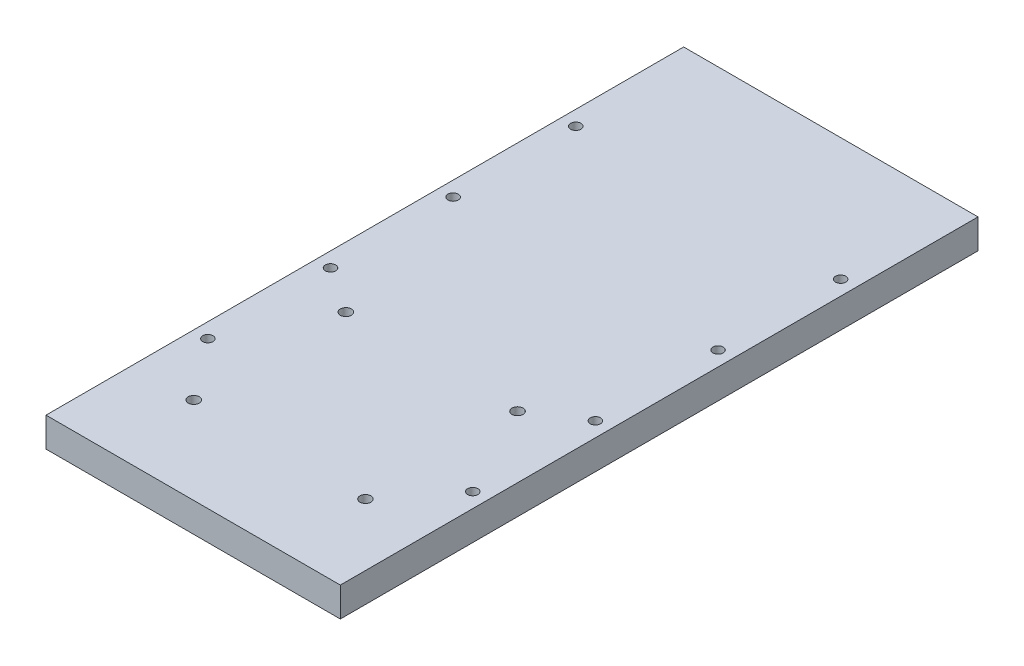
ISO-10303-21;
HEADER;
FILE_DESCRIPTION(('STEP AP214'),'2;1');
FILE_NAME('part.step','',(''),(''),'','','');
FILE_SCHEMA(('AUTOMOTIVE_DESIGN { 1 0 10303 214 1 1 1 1 }'));
ENDSEC;
DATA;
#1=APPLICATION_CONTEXT('core data for automotive mechanical design processes');
#2=APPLICATION_PROTOCOL_DEFINITION('international standard','automotive_design',2000,#1);
#3=PRODUCT_CONTEXT('',#1,'mechanical');
#4=PRODUCT('Part','Part','',(#3));
#5=PRODUCT_RELATED_PRODUCT_CATEGORY('part','',(#4));
#6=PRODUCT_DEFINITION_FORMATION('','',#4);
#7=PRODUCT_DEFINITION_CONTEXT('part definition',#1,'design');
#8=PRODUCT_DEFINITION('design','',#6,#7);
#9=PRODUCT_DEFINITION_SHAPE('','',#8);
#10=(LENGTH_UNIT() NAMED_UNIT(*) SI_UNIT(.MILLI.,.METRE.));
#11=(NAMED_UNIT(*) PLANE_ANGLE_UNIT() SI_UNIT($,.RADIAN.));
#12=(NAMED_UNIT(*) SI_UNIT($,.STERADIAN.) SOLID_ANGLE_UNIT());
#13=UNCERTAINTY_MEASURE_WITH_UNIT(LENGTH_MEASURE(1.E-05),#10,'distance_accuracy_value','');
#14=(GEOMETRIC_REPRESENTATION_CONTEXT(3) GLOBAL_UNCERTAINTY_ASSIGNED_CONTEXT((#13)) GLOBAL_UNIT_ASSIGNED_CONTEXT((#10,
#11,#12)) REPRESENTATION_CONTEXT('',''));
#15=CARTESIAN_POINT('',(0.,0.,0.));
#16=DIRECTION('',(0.,0.,1.));
#17=DIRECTION('',(1.,0.,0.));
#18=AXIS2_PLACEMENT_3D('',#15,#16,#17);
#19=CARTESIAN_POINT('',(0.,0.,-115.));
#20=DIRECTION('',(0.,0.,-1.));
#21=DIRECTION('',(-1.,0.,0.));
#22=AXIS2_PLACEMENT_3D('',#19,#20,#21);
#23=PLANE('',#22);
#24=CARTESIAN_POINT('',(-54.,6.,-115.));
#25=DIRECTION('',(0.,0.,-1.));
#26=DIRECTION('',(-1.,0.,0.));
#27=AXIS2_PLACEMENT_3D('',#24,#25,#26);
#28=CIRCLE('',#27,2.25);
#29=CARTESIAN_POINT('',(-56.25,6.,-115.));
#30=VERTEX_POINT('',#29);
#31=EDGE_CURVE('E196',#30,#30,#28,.T.);
#32=ORIENTED_EDGE('',*,*,#31,.T.);
#33=EDGE_LOOP('',(#32));
#34=FACE_BOUND('',#33,.T.);
#35=ADVANCED_FACE('F17',(#34),#23,.T.);
#36=CARTESIAN_POINT('',(0.,0.,-115.));
#37=DIRECTION('',(0.,0.,-1.));
#38=DIRECTION('',(-1.,0.,0.));
#39=AXIS2_PLACEMENT_3D('',#36,#37,#38);
#40=PLANE('',#39);
#41=CARTESIAN_POINT('',(0.,6.,-115.));
#42=DIRECTION('',(0.,0.,-1.));
#43=DIRECTION('',(-1.,0.,0.));
#44=AXIS2_PLACEMENT_3D('',#41,#42,#43);
#45=CIRCLE('',#44,2.25);
#46=CARTESIAN_POINT('',(-2.25,6.,-115.));
#47=VERTEX_POINT('',#46);
#48=EDGE_CURVE('E193',#47,#47,#45,.T.);
#49=ORIENTED_EDGE('',*,*,#48,.T.);
#50=EDGE_LOOP('',(#49));
#51=FACE_BOUND('',#50,.T.);
#52=ADVANCED_FACE('F395',(#51),#40,.T.);
#53=CARTESIAN_POINT('',(0.,0.,-115.));
#54=DIRECTION('',(0.,0.,-1.));
#55=DIRECTION('',(-1.,0.,0.));
#56=AXIS2_PLACEMENT_3D('',#53,#54,#55);
#57=PLANE('',#56);
#58=CARTESIAN_POINT('',(54.,6.,-115.));
#59=DIRECTION('',(0.,0.,-1.));
#60=DIRECTION('',(-1.,0.,0.));
#61=AXIS2_PLACEMENT_3D('',#58,#59,#60);
#62=CIRCLE('',#61,2.25);
#63=CARTESIAN_POINT('',(51.75,6.,-115.));
#64=VERTEX_POINT('',#63);
#65=EDGE_CURVE('E190',#64,#64,#62,.T.);
#66=ORIENTED_EDGE('',*,*,#65,.T.);
#67=EDGE_LOOP('',(#66));
#68=FACE_BOUND('',#67,.T.);
#69=ADVANCED_FACE('F392',(#68),#57,.T.);
#70=CARTESIAN_POINT('',(54.,0.,70.));
#71=DIRECTION('',(0.,-1.,0.));
#72=DIRECTION('',(0.,0.,-1.));
#73=AXIS2_PLACEMENT_3D('',#70,#71,#72);
#74=CYLINDRICAL_SURFACE('',#73,3.60000000000001);
#75=CARTESIAN_POINT('',(54.,6.,70.));
#76=DIRECTION('',(0.,-1.,0.));
#77=DIRECTION('',(0.,0.,-1.));
#78=AXIS2_PLACEMENT_3D('',#75,#76,#77);
#79=CIRCLE('',#78,3.60000000000001);
#80=CARTESIAN_POINT('',(54.,6.,66.4));
#81=VERTEX_POINT('',#80);
#82=EDGE_CURVE('E214',#81,#81,#79,.T.);
#83=ORIENTED_EDGE('',*,*,#82,.F.);
#84=EDGE_LOOP('',(#83));
#85=FACE_BOUND('',#84,.T.);
#86=CARTESIAN_POINT('',(54.,0.,70.));
#87=DIRECTION('',(0.,-1.,0.));
#88=DIRECTION('',(0.,0.,-1.));
#89=AXIS2_PLACEMENT_3D('',#86,#87,#88);
#90=CIRCLE('',#89,3.60000000000001);
#91=CARTESIAN_POINT('',(54.,0.,66.4));
#92=VERTEX_POINT('',#91);
#93=EDGE_CURVE('E187',#92,#92,#90,.T.);
#94=ORIENTED_EDGE('',*,*,#93,.T.);
#95=EDGE_LOOP('',(#94));
#96=FACE_BOUND('',#95,.T.);
#97=ADVANCED_FACE('F388',(#85,#96),#74,.F.);
#98=CARTESIAN_POINT('',(54.,0.,20.));
#99=DIRECTION('',(0.,-1.,0.));
#100=DIRECTION('',(0.,0.,-1.));
#101=AXIS2_PLACEMENT_3D('',#98,#99,#100);
#102=CYLINDRICAL_SURFACE('',#101,3.6);
#103=CARTESIAN_POINT('',(54.,6.,20.));
#104=DIRECTION('',(0.,-1.,0.));
#105=DIRECTION('',(0.,0.,-1.));
#106=AXIS2_PLACEMENT_3D('',#103,#104,#105);
#107=CIRCLE('',#106,3.6);
#108=CARTESIAN_POINT('',(54.,6.,16.4));
#109=VERTEX_POINT('',#108);
#110=EDGE_CURVE('E211',#109,#109,#107,.T.);
#111=ORIENTED_EDGE('',*,*,#110,.F.);
#112=EDGE_LOOP('',(#111));
#113=FACE_BOUND('',#112,.T.);
#114=CARTESIAN_POINT('',(54.,0.,20.));
#115=DIRECTION('',(0.,-1.,0.));
#116=DIRECTION('',(0.,0.,-1.));
#117=AXIS2_PLACEMENT_3D('',#114,#115,#116);
#118=CIRCLE('',#117,3.6);
#119=CARTESIAN_POINT('',(54.,0.,16.4));
#120=VERTEX_POINT('',#119);
#121=EDGE_CURVE('E184',#120,#120,#118,.T.);
#122=ORIENTED_EDGE('',*,*,#121,.T.);
#123=EDGE_LOOP('',(#122));
#124=FACE_BOUND('',#123,.T.);
#125=ADVANCED_FACE('F384',(#113,#124),#102,.F.);
#126=CARTESIAN_POINT('',(54.,0.,-30.));
#127=DIRECTION('',(0.,-1.,0.));
#128=DIRECTION('',(0.,0.,-1.));
#129=AXIS2_PLACEMENT_3D('',#126,#127,#128);
#130=CYLINDRICAL_SURFACE('',#129,3.6);
#131=CARTESIAN_POINT('',(54.,6.,-30.));
#132=DIRECTION('',(0.,-1.,0.));
#133=DIRECTION('',(0.,0.,-1.));
#134=AXIS2_PLACEMENT_3D('',#131,#132,#133);
#135=CIRCLE('',#134,3.6);
#136=CARTESIAN_POINT('',(54.,6.,-33.6));
#137=VERTEX_POINT('',#136);
#138=EDGE_CURVE('E205',#137,#137,#135,.T.);
#139=ORIENTED_EDGE('',*,*,#138,.F.);
#140=EDGE_LOOP('',(#139));
#141=FACE_BOUND('',#140,.T.);
#142=CARTESIAN_POINT('',(54.,0.,-30.));
#143=DIRECTION('',(0.,-1.,0.));
#144=DIRECTION('',(0.,0.,-1.));
#145=AXIS2_PLACEMENT_3D('',#142,#143,#144);
#146=CIRCLE('',#145,3.6);
#147=CARTESIAN_POINT('',(54.,0.,-33.6));
#148=VERTEX_POINT('',#147);
#149=EDGE_CURVE('E181',#148,#148,#146,.T.);
#150=ORIENTED_EDGE('',*,*,#149,.T.);
#151=EDGE_LOOP('',(#150));
#152=FACE_BOUND('',#151,.T.);
#153=ADVANCED_FACE('F380',(#141,#152),#130,.F.);
#154=CARTESIAN_POINT('',(54.,0.,-80.));
#155=DIRECTION('',(0.,-1.,0.));
#156=DIRECTION('',(0.,0.,-1.));
#157=AXIS2_PLACEMENT_3D('',#154,#155,#156);
#158=CYLINDRICAL_SURFACE('',#157,3.60000000000001);
#159=CARTESIAN_POINT('',(54.,6.,-80.));
#160=DIRECTION('',(0.,-1.,0.));
#161=DIRECTION('',(0.,0.,-1.));
#162=AXIS2_PLACEMENT_3D('',#159,#160,#161);
#163=CIRCLE('',#162,3.60000000000001);
#164=CARTESIAN_POINT('',(54.,6.,-83.6));
#165=VERTEX_POINT('',#164);
#166=EDGE_CURVE('E208',#165,#165,#163,.T.);
#167=ORIENTED_EDGE('',*,*,#166,.F.);
#168=EDGE_LOOP('',(#167));
#169=FACE_BOUND('',#168,.T.);
#170=CARTESIAN_POINT('',(54.,0.,-80.));
#171=DIRECTION('',(0.,-1.,0.));
#172=DIRECTION('',(0.,0.,-1.));
#173=AXIS2_PLACEMENT_3D('',#170,#171,#172);
#174=CIRCLE('',#173,3.60000000000001);
#175=CARTESIAN_POINT('',(54.,0.,-83.6));
#176=VERTEX_POINT('',#175);
#177=EDGE_CURVE('E178',#176,#176,#174,.T.);
#178=ORIENTED_EDGE('',*,*,#177,.T.);
#179=EDGE_LOOP('',(#178));
#180=FACE_BOUND('',#179,.T.);
#181=ADVANCED_FACE('F376',(#169,#180),#158,.F.);
#182=CARTESIAN_POINT('',(-54.,0.,70.));
#183=DIRECTION('',(0.,-1.,0.));
#184=DIRECTION('',(0.,0.,-1.));
#185=AXIS2_PLACEMENT_3D('',#182,#183,#184);
#186=CYLINDRICAL_SURFACE('',#185,3.60000000000001);
#187=CARTESIAN_POINT('',(-54.,6.,70.));
#188=DIRECTION('',(0.,-1.,0.));
#189=DIRECTION('',(0.,0.,-1.));
#190=AXIS2_PLACEMENT_3D('',#187,#188,#189);
#191=CIRCLE('',#190,3.60000000000001);
#192=CARTESIAN_POINT('',(-54.,6.,66.4));
#193=VERTEX_POINT('',#192);
#194=EDGE_CURVE('E216',#193,#193,#191,.T.);
#195=ORIENTED_EDGE('',*,*,#194,.F.);
#196=EDGE_LOOP('',(#195));
#197=FACE_BOUND('',#196,.T.);
#198=CARTESIAN_POINT('',(-54.,0.,70.));
#199=DIRECTION('',(0.,-1.,0.));
#200=DIRECTION('',(0.,0.,-1.));
#201=AXIS2_PLACEMENT_3D('',#198,#199,#200);
#202=CIRCLE('',#201,3.60000000000001);
#203=CARTESIAN_POINT('',(-54.,0.,66.4));
#204=VERTEX_POINT('',#203);
#205=EDGE_CURVE('E175',#204,#204,#202,.T.);
#206=ORIENTED_EDGE('',*,*,#205,.T.);
#207=EDGE_LOOP('',(#206));
#208=FACE_BOUND('',#207,.T.);
#209=ADVANCED_FACE('F230',(#197,#208),#186,.F.);
#210=CARTESIAN_POINT('',(-54.,0.,20.));
#211=DIRECTION('',(0.,-1.,0.));
#212=DIRECTION('',(0.,0.,-1.));
#213=AXIS2_PLACEMENT_3D('',#210,#211,#212);
#214=CYLINDRICAL_SURFACE('',#213,3.6);
#215=CARTESIAN_POINT('',(-54.,6.,20.));
#216=DIRECTION('',(0.,-1.,0.));
#217=DIRECTION('',(0.,0.,-1.));
#218=AXIS2_PLACEMENT_3D('',#215,#216,#217);
#219=CIRCLE('',#218,3.6);
#220=CARTESIAN_POINT('',(-54.,6.,16.4));
#221=VERTEX_POINT('',#220);
#222=EDGE_CURVE('E20',#221,#221,#219,.T.);
#223=ORIENTED_EDGE('',*,*,#222,.F.);
#224=EDGE_LOOP('',(#223));
#225=FACE_BOUND('',#224,.T.);
#226=CARTESIAN_POINT('',(-54.,0.,20.));
#227=DIRECTION('',(0.,-1.,0.));
#228=DIRECTION('',(0.,0.,-1.));
#229=AXIS2_PLACEMENT_3D('',#226,#227,#228);
#230=CIRCLE('',#229,3.6);
#231=CARTESIAN_POINT('',(-54.,0.,16.4));
#232=VERTEX_POINT('',#231);
#233=EDGE_CURVE('E172',#232,#232,#230,.T.);
#234=ORIENTED_EDGE('',*,*,#233,.T.);
#235=EDGE_LOOP('',(#234));
#236=FACE_BOUND('',#235,.T.);
#237=ADVANCED_FACE('F226',(#225,#236),#214,.F.);
#238=CARTESIAN_POINT('',(-54.,0.,-30.));
#239=DIRECTION('',(0.,-1.,0.));
#240=DIRECTION('',(0.,0.,-1.));
#241=AXIS2_PLACEMENT_3D('',#238,#239,#240);
#242=CYLINDRICAL_SURFACE('',#241,3.6);
#243=CARTESIAN_POINT('',(-54.,6.,-30.));
#244=DIRECTION('',(0.,-1.,0.));
#245=DIRECTION('',(0.,0.,-1.));
#246=AXIS2_PLACEMENT_3D('',#243,#244,#245);
#247=CIRCLE('',#246,3.6);
#248=CARTESIAN_POINT('',(-54.,6.,-33.6));
#249=VERTEX_POINT('',#248);
#250=EDGE_CURVE('E199',#249,#249,#247,.T.);
#251=ORIENTED_EDGE('',*,*,#250,.F.);
#252=EDGE_LOOP('',(#251));
#253=FACE_BOUND('',#252,.T.);
#254=CARTESIAN_POINT('',(-54.,0.,-30.));
#255=DIRECTION('',(0.,-1.,0.));
#256=DIRECTION('',(0.,0.,-1.));
#257=AXIS2_PLACEMENT_3D('',#254,#255,#256);
#258=CIRCLE('',#257,3.6);
#259=CARTESIAN_POINT('',(-54.,0.,-33.6));
#260=VERTEX_POINT('',#259);
#261=EDGE_CURVE('E169',#260,#260,#258,.T.);
#262=ORIENTED_EDGE('',*,*,#261,.T.);
#263=EDGE_LOOP('',(#262));
#264=FACE_BOUND('',#263,.T.);
#265=ADVANCED_FACE('F229',(#253,#264),#242,.F.);
#266=CARTESIAN_POINT('',(-54.,0.,-80.));
#267=DIRECTION('',(0.,-1.,0.));
#268=DIRECTION('',(0.,0.,-1.));
#269=AXIS2_PLACEMENT_3D('',#266,#267,#268);
#270=CYLINDRICAL_SURFACE('',#269,3.60000000000001);
#271=CARTESIAN_POINT('',(-54.,6.,-80.));
#272=DIRECTION('',(0.,-1.,0.));
#273=DIRECTION('',(0.,0.,-1.));
#274=AXIS2_PLACEMENT_3D('',#271,#272,#273);
#275=CIRCLE('',#274,3.60000000000001);
#276=CARTESIAN_POINT('',(-54.,6.,-83.6));
#277=VERTEX_POINT('',#276);
#278=EDGE_CURVE('E202',#277,#277,#275,.T.);
#279=ORIENTED_EDGE('',*,*,#278,.F.);
#280=EDGE_LOOP('',(#279));
#281=FACE_BOUND('',#280,.T.);
#282=CARTESIAN_POINT('',(-54.,0.,-80.));
#283=DIRECTION('',(0.,-1.,0.));
#284=DIRECTION('',(0.,0.,-1.));
#285=AXIS2_PLACEMENT_3D('',#282,#283,#284);
#286=CIRCLE('',#285,3.60000000000001);
#287=CARTESIAN_POINT('',(-54.,0.,-83.6));
#288=VERTEX_POINT('',#287);
#289=EDGE_CURVE('E166',#288,#288,#286,.T.);
#290=ORIENTED_EDGE('',*,*,#289,.T.);
#291=EDGE_LOOP('',(#290));
#292=FACE_BOUND('',#291,.T.);
#293=ADVANCED_FACE('F367',(#281,#292),#270,.F.);
#294=CARTESIAN_POINT('',(0.,6.,0.));
#295=DIRECTION('',(0.,-1.,0.));
#296=DIRECTION('',(0.,0.,-1.));
#297=AXIS2_PLACEMENT_3D('',#294,#295,#296);
#298=PLANE('',#297);
#299=ORIENTED_EDGE('',*,*,#222,.T.);
#300=EDGE_LOOP('',(#299));
#301=FACE_BOUND('',#300,.T.);
#302=CARTESIAN_POINT('',(-54.,6.,20.));
#303=DIRECTION('',(0.,-1.,0.));
#304=DIRECTION('',(0.,0.,-1.));
#305=AXIS2_PLACEMENT_3D('',#302,#303,#304);
#306=CIRCLE('',#305,2.1);
#307=CARTESIAN_POINT('',(-54.,6.,17.9));
#308=VERTEX_POINT('',#307);
#309=EDGE_CURVE('E151',#308,#308,#306,.F.);
#310=ORIENTED_EDGE('',*,*,#309,.T.);
#311=EDGE_LOOP('',(#310));
#312=FACE_BOUND('',#311,.T.);
#313=ADVANCED_FACE('F223',(#301,#312),#298,.T.);
#314=CARTESIAN_POINT('',(0.,6.,0.));
#315=DIRECTION('',(0.,-1.,0.));
#316=DIRECTION('',(0.,0.,-1.));
#317=AXIS2_PLACEMENT_3D('',#314,#315,#316);
#318=PLANE('',#317);
#319=ORIENTED_EDGE('',*,*,#194,.T.);
#320=EDGE_LOOP('',(#319));
#321=FACE_BOUND('',#320,.T.);
#322=CARTESIAN_POINT('',(-54.,6.,70.));
#323=DIRECTION('',(0.,-1.,0.));
#324=DIRECTION('',(0.,0.,-1.));
#325=AXIS2_PLACEMENT_3D('',#322,#323,#324);
#326=CIRCLE('',#325,2.1);
#327=CARTESIAN_POINT('',(-54.,6.,67.9));
#328=VERTEX_POINT('',#327);
#329=EDGE_CURVE('E148',#328,#328,#326,.F.);
#330=ORIENTED_EDGE('',*,*,#329,.T.);
#331=EDGE_LOOP('',(#330));
#332=FACE_BOUND('',#331,.T.);
#333=ADVANCED_FACE('F361',(#321,#332),#318,.T.);
#334=CARTESIAN_POINT('',(0.,6.,0.));
#335=DIRECTION('',(0.,-1.,0.));
#336=DIRECTION('',(0.,0.,-1.));
#337=AXIS2_PLACEMENT_3D('',#334,#335,#336);
#338=PLANE('',#337);
#339=ORIENTED_EDGE('',*,*,#82,.T.);
#340=EDGE_LOOP('',(#339));
#341=FACE_BOUND('',#340,.T.);
#342=CARTESIAN_POINT('',(54.,6.,70.));
#343=DIRECTION('',(0.,-1.,0.));
#344=DIRECTION('',(0.,0.,-1.));
#345=AXIS2_PLACEMENT_3D('',#342,#343,#344);
#346=CIRCLE('',#345,2.1);
#347=CARTESIAN_POINT('',(54.,6.,67.9));
#348=VERTEX_POINT('',#347);
#349=EDGE_CURVE('E145',#348,#348,#346,.F.);
#350=ORIENTED_EDGE('',*,*,#349,.T.);
#351=EDGE_LOOP('',(#350));
#352=FACE_BOUND('',#351,.T.);
#353=ADVANCED_FACE('F357',(#341,#352),#338,.T.);
#354=CARTESIAN_POINT('',(0.,6.,0.));
#355=DIRECTION('',(0.,-1.,0.));
#356=DIRECTION('',(0.,0.,-1.));
#357=AXIS2_PLACEMENT_3D('',#354,#355,#356);
#358=PLANE('',#357);
#359=ORIENTED_EDGE('',*,*,#110,.T.);
#360=EDGE_LOOP('',(#359));
#361=FACE_BOUND('',#360,.T.);
#362=CARTESIAN_POINT('',(54.,6.,20.));
#363=DIRECTION('',(0.,-1.,0.));
#364=DIRECTION('',(0.,0.,-1.));
#365=AXIS2_PLACEMENT_3D('',#362,#363,#364);
#366=CIRCLE('',#365,2.1);
#367=CARTESIAN_POINT('',(54.,6.,17.9));
#368=VERTEX_POINT('',#367);
#369=EDGE_CURVE('E142',#368,#368,#366,.F.);
#370=ORIENTED_EDGE('',*,*,#369,.T.);
#371=EDGE_LOOP('',(#370));
#372=FACE_BOUND('',#371,.T.);
#373=ADVANCED_FACE('F353',(#361,#372),#358,.T.);
#374=CARTESIAN_POINT('',(0.,6.,0.));
#375=DIRECTION('',(0.,-1.,0.));
#376=DIRECTION('',(0.,0.,-1.));
#377=AXIS2_PLACEMENT_3D('',#374,#375,#376);
#378=PLANE('',#377);
#379=ORIENTED_EDGE('',*,*,#166,.T.);
#380=EDGE_LOOP('',(#379));
#381=FACE_BOUND('',#380,.T.);
#382=CARTESIAN_POINT('',(54.,6.,-80.));
#383=DIRECTION('',(0.,-1.,0.));
#384=DIRECTION('',(0.,0.,-1.));
#385=AXIS2_PLACEMENT_3D('',#382,#383,#384);
#386=CIRCLE('',#385,2.1);
#387=CARTESIAN_POINT('',(54.,6.,-82.1));
#388=VERTEX_POINT('',#387);
#389=EDGE_CURVE('E139',#388,#388,#386,.F.);
#390=ORIENTED_EDGE('',*,*,#389,.T.);
#391=EDGE_LOOP('',(#390));
#392=FACE_BOUND('',#391,.T.);
#393=ADVANCED_FACE('F349',(#381,#392),#378,.T.);
#394=CARTESIAN_POINT('',(0.,6.,0.));
#395=DIRECTION('',(0.,-1.,0.));
#396=DIRECTION('',(0.,0.,-1.));
#397=AXIS2_PLACEMENT_3D('',#394,#395,#396);
#398=PLANE('',#397);
#399=ORIENTED_EDGE('',*,*,#138,.T.);
#400=EDGE_LOOP('',(#399));
#401=FACE_BOUND('',#400,.T.);
#402=CARTESIAN_POINT('',(54.,6.,-30.));
#403=DIRECTION('',(0.,-1.,0.));
#404=DIRECTION('',(0.,0.,-1.));
#405=AXIS2_PLACEMENT_3D('',#402,#403,#404);
#406=CIRCLE('',#405,2.1);
#407=CARTESIAN_POINT('',(54.,6.,-32.1));
#408=VERTEX_POINT('',#407);
#409=EDGE_CURVE('E136',#408,#408,#406,.F.);
#410=ORIENTED_EDGE('',*,*,#409,.T.);
#411=EDGE_LOOP('',(#410));
#412=FACE_BOUND('',#411,.T.);
#413=ADVANCED_FACE('F345',(#401,#412),#398,.T.);
#414=CARTESIAN_POINT('',(0.,6.,0.));
#415=DIRECTION('',(0.,-1.,0.));
#416=DIRECTION('',(0.,0.,-1.));
#417=AXIS2_PLACEMENT_3D('',#414,#415,#416);
#418=PLANE('',#417);
#419=ORIENTED_EDGE('',*,*,#278,.T.);
#420=EDGE_LOOP('',(#419));
#421=FACE_BOUND('',#420,.T.);
#422=CARTESIAN_POINT('',(-54.,6.,-80.));
#423=DIRECTION('',(0.,-1.,0.));
#424=DIRECTION('',(0.,0.,-1.));
#425=AXIS2_PLACEMENT_3D('',#422,#423,#424);
#426=CIRCLE('',#425,2.1);
#427=CARTESIAN_POINT('',(-54.,6.,-82.1));
#428=VERTEX_POINT('',#427);
#429=EDGE_CURVE('E133',#428,#428,#426,.F.);
#430=ORIENTED_EDGE('',*,*,#429,.T.);
#431=EDGE_LOOP('',(#430));
#432=FACE_BOUND('',#431,.T.);
#433=ADVANCED_FACE('F341',(#421,#432),#418,.T.);
#434=CARTESIAN_POINT('',(0.,6.,0.));
#435=DIRECTION('',(0.,-1.,0.));
#436=DIRECTION('',(0.,0.,-1.));
#437=AXIS2_PLACEMENT_3D('',#434,#435,#436);
#438=PLANE('',#437);
#439=ORIENTED_EDGE('',*,*,#250,.T.);
#440=EDGE_LOOP('',(#439));
#441=FACE_BOUND('',#440,.T.);
#442=CARTESIAN_POINT('',(-54.,6.,-30.));
#443=DIRECTION('',(0.,-1.,0.));
#444=DIRECTION('',(0.,0.,-1.));
#445=AXIS2_PLACEMENT_3D('',#442,#443,#444);
#446=CIRCLE('',#445,2.1);
#447=CARTESIAN_POINT('',(-54.,6.,-32.1));
#448=VERTEX_POINT('',#447);
#449=EDGE_CURVE('E130',#448,#448,#446,.F.);
#450=ORIENTED_EDGE('',*,*,#449,.T.);
#451=EDGE_LOOP('',(#450));
#452=FACE_BOUND('',#451,.T.);
#453=ADVANCED_FACE('F337',(#441,#452),#438,.T.);
#454=CARTESIAN_POINT('',(-54.,6.,-130.));
#455=DIRECTION('',(0.,0.,-1.));
#456=DIRECTION('',(-1.,0.,0.));
#457=AXIS2_PLACEMENT_3D('',#454,#455,#456);
#458=CYLINDRICAL_SURFACE('',#457,2.25);
#459=ORIENTED_EDGE('',*,*,#31,.F.);
#460=EDGE_LOOP('',(#459));
#461=FACE_BOUND('',#460,.T.);
#462=CARTESIAN_POINT('',(-54.,6.,-130.));
#463=DIRECTION('',(0.,0.,-1.));
#464=DIRECTION('',(-1.,0.,0.));
#465=AXIS2_PLACEMENT_3D('',#462,#463,#464);
#466=CIRCLE('',#465,2.25);
#467=CARTESIAN_POINT('',(-56.25,6.,-130.));
#468=VERTEX_POINT('',#467);
#469=EDGE_CURVE('E127',#468,#468,#466,.F.);
#470=ORIENTED_EDGE('',*,*,#469,.F.);
#471=EDGE_LOOP('',(#470));
#472=FACE_BOUND('',#471,.T.);
#473=ADVANCED_FACE('F333',(#461,#472),#458,.F.);
#474=CARTESIAN_POINT('',(0.,6.,-130.));
#475=DIRECTION('',(0.,0.,-1.));
#476=DIRECTION('',(-1.,0.,0.));
#477=AXIS2_PLACEMENT_3D('',#474,#475,#476);
#478=CYLINDRICAL_SURFACE('',#477,2.25);
#479=ORIENTED_EDGE('',*,*,#48,.F.);
#480=EDGE_LOOP('',(#479));
#481=FACE_BOUND('',#480,.T.);
#482=CARTESIAN_POINT('',(0.,6.,-130.));
#483=DIRECTION('',(0.,0.,-1.));
#484=DIRECTION('',(-1.,0.,0.));
#485=AXIS2_PLACEMENT_3D('',#482,#483,#484);
#486=CIRCLE('',#485,2.25);
#487=CARTESIAN_POINT('',(-2.25,6.,-130.));
#488=VERTEX_POINT('',#487);
#489=EDGE_CURVE('E124',#488,#488,#486,.F.);
#490=ORIENTED_EDGE('',*,*,#489,.F.);
#491=EDGE_LOOP('',(#490));
#492=FACE_BOUND('',#491,.T.);
#493=ADVANCED_FACE('F329',(#481,#492),#478,.F.);
#494=CARTESIAN_POINT('',(54.,6.,-130.));
#495=DIRECTION('',(0.,0.,-1.));
#496=DIRECTION('',(-1.,0.,0.));
#497=AXIS2_PLACEMENT_3D('',#494,#495,#496);
#498=CYLINDRICAL_SURFACE('',#497,2.25);
#499=ORIENTED_EDGE('',*,*,#65,.F.);
#500=EDGE_LOOP('',(#499));
#501=FACE_BOUND('',#500,.T.);
#502=CARTESIAN_POINT('',(54.,6.,-130.));
#503=DIRECTION('',(0.,0.,-1.));
#504=DIRECTION('',(-1.,0.,0.));
#505=AXIS2_PLACEMENT_3D('',#502,#503,#504);
#506=CIRCLE('',#505,2.25);
#507=CARTESIAN_POINT('',(51.75,6.,-130.));
#508=VERTEX_POINT('',#507);
#509=EDGE_CURVE('E70',#508,#508,#506,.F.);
#510=ORIENTED_EDGE('',*,*,#509,.F.);
#511=EDGE_LOOP('',(#510));
#512=FACE_BOUND('',#511,.T.);
#513=ADVANCED_FACE('F237',(#501,#512),#498,.F.);
#514=CARTESIAN_POINT('',(0.,0.,0.));
#515=DIRECTION('',(0.,1.,0.));
#516=DIRECTION('',(0.,0.,1.));
#517=AXIS2_PLACEMENT_3D('',#514,#515,#516);
#518=PLANE('',#517);
#519=DIRECTION('',(1.,0.,0.));
#520=VECTOR('',#519,1.);
#521=CARTESIAN_POINT('',(-60.,0.,130.));
#522=LINE('',#521,#520);
#523=CARTESIAN_POINT('',(-60.,0.,130.));
#524=VERTEX_POINT('',#523);
#525=CARTESIAN_POINT('',(60.,0.,130.));
#526=VERTEX_POINT('',#525);
#527=EDGE_CURVE('E74',#524,#526,#522,.T.);
#528=ORIENTED_EDGE('',*,*,#527,.F.);
#529=DIRECTION('',(0.,0.,1.));
#530=VECTOR('',#529,1.);
#531=CARTESIAN_POINT('',(-60.,0.,-130.));
#532=LINE('',#531,#530);
#533=CARTESIAN_POINT('',(-60.,0.,-130.));
#534=VERTEX_POINT('',#533);
#535=EDGE_CURVE('E55',#534,#524,#532,.T.);
#536=ORIENTED_EDGE('',*,*,#535,.F.);
#537=DIRECTION('',(-1.,0.,0.));
#538=VECTOR('',#537,1.);
#539=CARTESIAN_POINT('',(60.,0.,-130.));
#540=LINE('',#539,#538);
#541=CARTESIAN_POINT('',(60.,0.,-130.));
#542=VERTEX_POINT('',#541);
#543=EDGE_CURVE('E60',#542,#534,#540,.T.);
#544=ORIENTED_EDGE('',*,*,#543,.F.);
#545=DIRECTION('',(0.,0.,-1.));
#546=VECTOR('',#545,1.);
#547=CARTESIAN_POINT('',(60.,0.,130.));
#548=LINE('',#547,#546);
#549=EDGE_CURVE('E730',#526,#542,#548,.T.);
#550=ORIENTED_EDGE('',*,*,#549,.F.);
#551=EDGE_LOOP('',(#528,#536,#544,#550));
#552=FACE_BOUND('',#551,.T.);
#553=ORIENTED_EDGE('',*,*,#289,.F.);
#554=EDGE_LOOP('',(#553));
#555=FACE_BOUND('',#554,.T.);
#556=ORIENTED_EDGE('',*,*,#261,.F.);
#557=EDGE_LOOP('',(#556));
#558=FACE_BOUND('',#557,.T.);
#559=ORIENTED_EDGE('',*,*,#233,.F.);
#560=EDGE_LOOP('',(#559));
#561=FACE_BOUND('',#560,.T.);
#562=ORIENTED_EDGE('',*,*,#205,.F.);
#563=EDGE_LOOP('',(#562));
#564=FACE_BOUND('',#563,.T.);
#565=ORIENTED_EDGE('',*,*,#177,.F.);
#566=EDGE_LOOP('',(#565));
#567=FACE_BOUND('',#566,.T.);
#568=ORIENTED_EDGE('',*,*,#149,.F.);
#569=EDGE_LOOP('',(#568));
#570=FACE_BOUND('',#569,.T.);
#571=ORIENTED_EDGE('',*,*,#121,.F.);
#572=EDGE_LOOP('',(#571));
#573=FACE_BOUND('',#572,.T.);
#574=ORIENTED_EDGE('',*,*,#93,.F.);
#575=EDGE_LOOP('',(#574));
#576=FACE_BOUND('',#575,.T.);
#577=CARTESIAN_POINT('',(-35.25,0.,32.5));
#578=DIRECTION('',(0.,1.,0.));
#579=DIRECTION('',(0.,0.,1.));
#580=AXIS2_PLACEMENT_3D('',#577,#578,#579);
#581=CIRCLE('',#580,2.25);
#582=CARTESIAN_POINT('',(-35.25,0.,34.75));
#583=VERTEX_POINT('',#582);
#584=EDGE_CURVE('E154',#583,#583,#581,.T.);
#585=ORIENTED_EDGE('',*,*,#584,.T.);
#586=EDGE_LOOP('',(#585));
#587=FACE_BOUND('',#586,.T.);
#588=CARTESIAN_POINT('',(-35.25,0.,94.5));
#589=DIRECTION('',(0.,1.,0.));
#590=DIRECTION('',(0.,0.,1.));
#591=AXIS2_PLACEMENT_3D('',#588,#589,#590);
#592=CIRCLE('',#591,2.25);
#593=CARTESIAN_POINT('',(-35.25,0.,96.75));
#594=VERTEX_POINT('',#593);
#595=EDGE_CURVE('E157',#594,#594,#592,.T.);
#596=ORIENTED_EDGE('',*,*,#595,.T.);
#597=EDGE_LOOP('',(#596));
#598=FACE_BOUND('',#597,.T.);
#599=CARTESIAN_POINT('',(34.75,0.,32.5));
#600=DIRECTION('',(0.,1.,0.));
#601=DIRECTION('',(0.,0.,1.));
#602=AXIS2_PLACEMENT_3D('',#599,#600,#601);
#603=CIRCLE('',#602,2.25);
#604=CARTESIAN_POINT('',(34.75,0.,34.75));
#605=VERTEX_POINT('',#604);
#606=EDGE_CURVE('E160',#605,#605,#603,.T.);
#607=ORIENTED_EDGE('',*,*,#606,.T.);
#608=EDGE_LOOP('',(#607));
#609=FACE_BOUND('',#608,.T.);
#610=CARTESIAN_POINT('',(34.75,0.,94.5));
#611=DIRECTION('',(0.,1.,0.));
#612=DIRECTION('',(0.,0.,1.));
#613=AXIS2_PLACEMENT_3D('',#610,#611,#612);
#614=CIRCLE('',#613,2.25);
#615=CARTESIAN_POINT('',(34.75,0.,96.75));
#616=VERTEX_POINT('',#615);
#617=EDGE_CURVE('E163',#616,#616,#614,.T.);
#618=ORIENTED_EDGE('',*,*,#617,.T.);
#619=EDGE_LOOP('',(#618));
#620=FACE_BOUND('',#619,.T.);
#621=ADVANCED_FACE('F72',(#552,#555,#558,#561,#564,#567,#570,#573,#576,#587,#598,#609,#620),
#518,.F.);
#622=CARTESIAN_POINT('',(34.75,12.,94.5));
#623=DIRECTION('',(0.,1.,0.));
#624=DIRECTION('',(0.,0.,1.));
#625=AXIS2_PLACEMENT_3D('',#622,#623,#624);
#626=CYLINDRICAL_SURFACE('',#625,2.25);
#627=ORIENTED_EDGE('',*,*,#617,.F.);
#628=EDGE_LOOP('',(#627));
#629=FACE_BOUND('',#628,.T.);
#630=CARTESIAN_POINT('',(34.75,12.,94.5));
#631=DIRECTION('',(0.,1.,0.));
#632=DIRECTION('',(0.,0.,1.));
#633=AXIS2_PLACEMENT_3D('',#630,#631,#632);
#634=CIRCLE('',#633,2.25);
#635=CARTESIAN_POINT('',(34.75,12.,96.75));
#636=VERTEX_POINT('',#635);
#637=EDGE_CURVE('E119',#636,#636,#634,.F.);
#638=ORIENTED_EDGE('',*,*,#637,.F.);
#639=EDGE_LOOP('',(#638));
#640=FACE_BOUND('',#639,.T.);
#641=ADVANCED_FACE('F236',(#629,#640),#626,.F.);
#642=CARTESIAN_POINT('',(34.75,12.,32.5));
#643=DIRECTION('',(0.,1.,0.));
#644=DIRECTION('',(0.,0.,1.));
#645=AXIS2_PLACEMENT_3D('',#642,#643,#644);
#646=CYLINDRICAL_SURFACE('',#645,2.25);
#647=ORIENTED_EDGE('',*,*,#606,.F.);
#648=EDGE_LOOP('',(#647));
#649=FACE_BOUND('',#648,.T.);
#650=CARTESIAN_POINT('',(34.75,12.,32.5));
#651=DIRECTION('',(0.,1.,0.));
#652=DIRECTION('',(0.,0.,1.));
#653=AXIS2_PLACEMENT_3D('',#650,#651,#652);
#654=CIRCLE('',#653,2.25);
#655=CARTESIAN_POINT('',(34.75,12.,34.75));
#656=VERTEX_POINT('',#655);
#657=EDGE_CURVE('E116',#656,#656,#654,.F.);
#658=ORIENTED_EDGE('',*,*,#657,.F.);
#659=EDGE_LOOP('',(#658));
#660=FACE_BOUND('',#659,.T.);
#661=ADVANCED_FACE('F259',(#649,#660),#646,.F.);
#662=CARTESIAN_POINT('',(-35.25,12.,94.5));
#663=DIRECTION('',(0.,1.,0.));
#664=DIRECTION('',(0.,0.,1.));
#665=AXIS2_PLACEMENT_3D('',#662,#663,#664);
#666=CYLINDRICAL_SURFACE('',#665,2.25);
#667=ORIENTED_EDGE('',*,*,#595,.F.);
#668=EDGE_LOOP('',(#667));
#669=FACE_BOUND('',#668,.T.);
#670=CARTESIAN_POINT('',(-35.25,12.,94.5));
#671=DIRECTION('',(0.,1.,0.));
#672=DIRECTION('',(0.,0.,1.));
#673=AXIS2_PLACEMENT_3D('',#670,#671,#672);
#674=CIRCLE('',#673,2.25);
#675=CARTESIAN_POINT('',(-35.25,12.,96.75));
#676=VERTEX_POINT('',#675);
#677=EDGE_CURVE('E113',#676,#676,#674,.F.);
#678=ORIENTED_EDGE('',*,*,#677,.F.);
#679=EDGE_LOOP('',(#678));
#680=FACE_BOUND('',#679,.T.);
#681=ADVANCED_FACE('F319',(#669,#680),#666,.F.);
#682=CARTESIAN_POINT('',(-35.25,12.,32.5));
#683=DIRECTION('',(0.,1.,0.));
#684=DIRECTION('',(0.,0.,1.));
#685=AXIS2_PLACEMENT_3D('',#682,#683,#684);
#686=CYLINDRICAL_SURFACE('',#685,2.25);
#687=ORIENTED_EDGE('',*,*,#584,.F.);
#688=EDGE_LOOP('',(#687));
#689=FACE_BOUND('',#688,.T.);
#690=CARTESIAN_POINT('',(-35.25,12.,32.5));
#691=DIRECTION('',(0.,1.,0.));
#692=DIRECTION('',(0.,0.,1.));
#693=AXIS2_PLACEMENT_3D('',#690,#691,#692);
#694=CIRCLE('',#693,2.25);
#695=CARTESIAN_POINT('',(-35.25,12.,34.75));
#696=VERTEX_POINT('',#695);
#697=EDGE_CURVE('E110',#696,#696,#694,.F.);
#698=ORIENTED_EDGE('',*,*,#697,.F.);
#699=EDGE_LOOP('',(#698));
#700=FACE_BOUND('',#699,.T.);
#701=ADVANCED_FACE('F315',(#689,#700),#686,.F.);
#702=CARTESIAN_POINT('',(-54.,0.,20.));
#703=DIRECTION('',(0.,-1.,0.));
#704=DIRECTION('',(0.,0.,-1.));
#705=AXIS2_PLACEMENT_3D('',#702,#703,#704);
#706=CYLINDRICAL_SURFACE('',#705,2.1);
#707=ORIENTED_EDGE('',*,*,#309,.F.);
#708=EDGE_LOOP('',(#707));
#709=FACE_BOUND('',#708,.T.);
#710=CARTESIAN_POINT('',(-54.,12.,20.));
#711=DIRECTION('',(0.,-1.,0.));
#712=DIRECTION('',(0.,0.,-1.));
#713=AXIS2_PLACEMENT_3D('',#710,#711,#712);
#714=CIRCLE('',#713,2.1);
#715=CARTESIAN_POINT('',(-54.,12.,17.9));
#716=VERTEX_POINT('',#715);
#717=EDGE_CURVE('E107',#716,#716,#714,.T.);
#718=ORIENTED_EDGE('',*,*,#717,.F.);
#719=EDGE_LOOP('',(#718));
#720=FACE_BOUND('',#719,.T.);
#721=ADVANCED_FACE('F311',(#709,#720),#706,.F.);
#722=CARTESIAN_POINT('',(-54.,0.,70.));
#723=DIRECTION('',(0.,-1.,0.));
#724=DIRECTION('',(0.,0.,-1.));
#725=AXIS2_PLACEMENT_3D('',#722,#723,#724);
#726=CYLINDRICAL_SURFACE('',#725,2.1);
#727=ORIENTED_EDGE('',*,*,#329,.F.);
#728=EDGE_LOOP('',(#727));
#729=FACE_BOUND('',#728,.T.);
#730=CARTESIAN_POINT('',(-54.,12.,70.));
#731=DIRECTION('',(0.,-1.,0.));
#732=DIRECTION('',(0.,0.,-1.));
#733=AXIS2_PLACEMENT_3D('',#730,#731,#732);
#734=CIRCLE('',#733,2.1);
#735=CARTESIAN_POINT('',(-54.,12.,67.9));
#736=VERTEX_POINT('',#735);
#737=EDGE_CURVE('E104',#736,#736,#734,.T.);
#738=ORIENTED_EDGE('',*,*,#737,.F.);
#739=EDGE_LOOP('',(#738));
#740=FACE_BOUND('',#739,.T.);
#741=ADVANCED_FACE('F307',(#729,#740),#726,.F.);
#742=CARTESIAN_POINT('',(54.,0.,70.));
#743=DIRECTION('',(0.,-1.,0.));
#744=DIRECTION('',(0.,0.,-1.));
#745=AXIS2_PLACEMENT_3D('',#742,#743,#744);
#746=CYLINDRICAL_SURFACE('',#745,2.1);
#747=ORIENTED_EDGE('',*,*,#349,.F.);
#748=EDGE_LOOP('',(#747));
#749=FACE_BOUND('',#748,.T.);
#750=CARTESIAN_POINT('',(54.,12.,70.));
#751=DIRECTION('',(0.,-1.,0.));
#752=DIRECTION('',(0.,0.,-1.));
#753=AXIS2_PLACEMENT_3D('',#750,#751,#752);
#754=CIRCLE('',#753,2.1);
#755=CARTESIAN_POINT('',(54.,12.,67.9));
#756=VERTEX_POINT('',#755);
#757=EDGE_CURVE('E101',#756,#756,#754,.T.);
#758=ORIENTED_EDGE('',*,*,#757,.F.);
#759=EDGE_LOOP('',(#758));
#760=FACE_BOUND('',#759,.T.);
#761=ADVANCED_FACE('F303',(#749,#760),#746,.F.);
#762=CARTESIAN_POINT('',(54.,0.,20.));
#763=DIRECTION('',(0.,-1.,0.));
#764=DIRECTION('',(0.,0.,-1.));
#765=AXIS2_PLACEMENT_3D('',#762,#763,#764);
#766=CYLINDRICAL_SURFACE('',#765,2.1);
#767=ORIENTED_EDGE('',*,*,#369,.F.);
#768=EDGE_LOOP('',(#767));
#769=FACE_BOUND('',#768,.T.);
#770=CARTESIAN_POINT('',(54.,12.,20.));
#771=DIRECTION('',(0.,-1.,0.));
#772=DIRECTION('',(0.,0.,-1.));
#773=AXIS2_PLACEMENT_3D('',#770,#771,#772);
#774=CIRCLE('',#773,2.1);
#775=CARTESIAN_POINT('',(54.,12.,17.9));
#776=VERTEX_POINT('',#775);
#777=EDGE_CURVE('E98',#776,#776,#774,.T.);
#778=ORIENTED_EDGE('',*,*,#777,.F.);
#779=EDGE_LOOP('',(#778));
#780=FACE_BOUND('',#779,.T.);
#781=ADVANCED_FACE('F299',(#769,#780),#766,.F.);
#782=CARTESIAN_POINT('',(54.,0.,-80.));
#783=DIRECTION('',(0.,-1.,0.));
#784=DIRECTION('',(0.,0.,-1.));
#785=AXIS2_PLACEMENT_3D('',#782,#783,#784);
#786=CYLINDRICAL_SURFACE('',#785,2.1);
#787=ORIENTED_EDGE('',*,*,#389,.F.);
#788=EDGE_LOOP('',(#787));
#789=FACE_BOUND('',#788,.T.);
#790=CARTESIAN_POINT('',(54.,12.,-80.));
#791=DIRECTION('',(0.,-1.,0.));
#792=DIRECTION('',(0.,0.,-1.));
#793=AXIS2_PLACEMENT_3D('',#790,#791,#792);
#794=CIRCLE('',#793,2.1);
#795=CARTESIAN_POINT('',(54.,12.,-82.1));
#796=VERTEX_POINT('',#795);
#797=EDGE_CURVE('E95',#796,#796,#794,.T.);
#798=ORIENTED_EDGE('',*,*,#797,.F.);
#799=EDGE_LOOP('',(#798));
#800=FACE_BOUND('',#799,.T.);
#801=ADVANCED_FACE('F295',(#789,#800),#786,.F.);
#802=CARTESIAN_POINT('',(54.,0.,-30.));
#803=DIRECTION('',(0.,-1.,0.));
#804=DIRECTION('',(0.,0.,-1.));
#805=AXIS2_PLACEMENT_3D('',#802,#803,#804);
#806=CYLINDRICAL_SURFACE('',#805,2.1);
#807=ORIENTED_EDGE('',*,*,#409,.F.);
#808=EDGE_LOOP('',(#807));
#809=FACE_BOUND('',#808,.T.);
#810=CARTESIAN_POINT('',(54.,12.,-30.));
#811=DIRECTION('',(0.,-1.,0.));
#812=DIRECTION('',(0.,0.,-1.));
#813=AXIS2_PLACEMENT_3D('',#810,#811,#812);
#814=CIRCLE('',#813,2.1);
#815=CARTESIAN_POINT('',(54.,12.,-32.1));
#816=VERTEX_POINT('',#815);
#817=EDGE_CURVE('E92',#816,#816,#814,.T.);
#818=ORIENTED_EDGE('',*,*,#817,.F.);
#819=EDGE_LOOP('',(#818));
#820=FACE_BOUND('',#819,.T.);
#821=ADVANCED_FACE('F291',(#809,#820),#806,.F.);
#822=CARTESIAN_POINT('',(-54.,0.,-80.));
#823=DIRECTION('',(0.,-1.,0.));
#824=DIRECTION('',(0.,0.,-1.));
#825=AXIS2_PLACEMENT_3D('',#822,#823,#824);
#826=CYLINDRICAL_SURFACE('',#825,2.1);
#827=ORIENTED_EDGE('',*,*,#429,.F.);
#828=EDGE_LOOP('',(#827));
#829=FACE_BOUND('',#828,.T.);
#830=CARTESIAN_POINT('',(-54.,12.,-80.));
#831=DIRECTION('',(0.,-1.,0.));
#832=DIRECTION('',(0.,0.,-1.));
#833=AXIS2_PLACEMENT_3D('',#830,#831,#832);
#834=CIRCLE('',#833,2.1);
#835=CARTESIAN_POINT('',(-54.,12.,-82.1));
#836=VERTEX_POINT('',#835);
#837=EDGE_CURVE('E89',#836,#836,#834,.T.);
#838=ORIENTED_EDGE('',*,*,#837,.F.);
#839=EDGE_LOOP('',(#838));
#840=FACE_BOUND('',#839,.T.);
#841=ADVANCED_FACE('F287',(#829,#840),#826,.F.);
#842=CARTESIAN_POINT('',(-54.,0.,-30.));
#843=DIRECTION('',(0.,-1.,0.));
#844=DIRECTION('',(0.,0.,-1.));
#845=AXIS2_PLACEMENT_3D('',#842,#843,#844);
#846=CYLINDRICAL_SURFACE('',#845,2.1);
#847=ORIENTED_EDGE('',*,*,#449,.F.);
#848=EDGE_LOOP('',(#847));
#849=FACE_BOUND('',#848,.T.);
#850=CARTESIAN_POINT('',(-54.,12.,-30.));
#851=DIRECTION('',(0.,-1.,0.));
#852=DIRECTION('',(0.,0.,-1.));
#853=AXIS2_PLACEMENT_3D('',#850,#851,#852);
#854=CIRCLE('',#853,2.1);
#855=CARTESIAN_POINT('',(-54.,12.,-32.1));
#856=VERTEX_POINT('',#855);
#857=EDGE_CURVE('E85',#856,#856,#854,.T.);
#858=ORIENTED_EDGE('',*,*,#857,.F.);
#859=EDGE_LOOP('',(#858));
#860=FACE_BOUND('',#859,.T.);
#861=ADVANCED_FACE('F284',(#849,#860),#846,.F.);
#862=CARTESIAN_POINT('',(60.,0.,-130.));
#863=DIRECTION('',(0.,0.,-1.));
#864=DIRECTION('',(-1.,0.,0.));
#865=AXIS2_PLACEMENT_3D('',#862,#863,#864);
#866=PLANE('',#865);
#867=DIRECTION('',(0.,1.,0.));
#868=VECTOR('',#867,1.);
#869=CARTESIAN_POINT('',(-60.,0.,-130.));
#870=LINE('',#869,#868);
#871=CARTESIAN_POINT('',(-60.,12.,-130.));
#872=VERTEX_POINT('',#871);
#873=EDGE_CURVE('E63',#872,#534,#870,.F.);
#874=ORIENTED_EDGE('',*,*,#873,.F.);
#875=DIRECTION('',(1.,0.,0.));
#876=VECTOR('',#875,1.);
#877=CARTESIAN_POINT('',(0.,12.,-130.));
#878=LINE('',#877,#876);
#879=CARTESIAN_POINT('',(60.,12.,-130.));
#880=VERTEX_POINT('',#879);
#881=EDGE_CURVE('E88',#880,#872,#878,.F.);
#882=ORIENTED_EDGE('',*,*,#881,.F.);
#883=DIRECTION('',(0.,1.,0.));
#884=VECTOR('',#883,1.);
#885=CARTESIAN_POINT('',(60.,0.,-130.));
#886=LINE('',#885,#884);
#887=EDGE_CURVE('E66',#542,#880,#886,.T.);
#888=ORIENTED_EDGE('',*,*,#887,.F.);
#889=ORIENTED_EDGE('',*,*,#543,.T.);
#890=EDGE_LOOP('',(#874,#882,#888,#889));
#891=FACE_BOUND('',#890,.T.);
#892=ORIENTED_EDGE('',*,*,#509,.T.);
#893=EDGE_LOOP('',(#892));
#894=FACE_BOUND('',#893,.T.);
#895=ORIENTED_EDGE('',*,*,#489,.T.);
#896=EDGE_LOOP('',(#895));
#897=FACE_BOUND('',#896,.T.);
#898=ORIENTED_EDGE('',*,*,#469,.T.);
#899=EDGE_LOOP('',(#898));
#900=FACE_BOUND('',#899,.T.);
#901=ADVANCED_FACE('F61',(#891,#894,#897,#900),#866,.T.);
#902=CARTESIAN_POINT('',(-60.,0.,-130.));
#903=DIRECTION('',(-1.,0.,0.));
#904=DIRECTION('',(0.,0.,1.));
#905=AXIS2_PLACEMENT_3D('',#902,#903,#904);
#906=PLANE('',#905);
#907=DIRECTION('',(0.,1.,0.));
#908=VECTOR('',#907,1.);
#909=CARTESIAN_POINT('',(-60.,0.,130.));
#910=LINE('',#909,#908);
#911=CARTESIAN_POINT('',(-60.,12.,130.));
#912=VERTEX_POINT('',#911);
#913=EDGE_CURVE('E76',#912,#524,#910,.F.);
#914=ORIENTED_EDGE('',*,*,#913,.F.);
#915=DIRECTION('',(0.,0.,1.));
#916=VECTOR('',#915,1.);
#917=CARTESIAN_POINT('',(-60.,12.,0.));
#918=LINE('',#917,#916);
#919=EDGE_CURVE('E80',#872,#912,#918,.T.);
#920=ORIENTED_EDGE('',*,*,#919,.F.);
#921=ORIENTED_EDGE('',*,*,#873,.T.);
#922=ORIENTED_EDGE('',*,*,#535,.T.);
#923=EDGE_LOOP('',(#914,#920,#921,#922));
#924=FACE_BOUND('',#923,.T.);
#925=ADVANCED_FACE('F78',(#924),#906,.T.);
#926=CARTESIAN_POINT('',(-60.,0.,130.));
#927=DIRECTION('',(0.,0.,1.));
#928=DIRECTION('',(1.,0.,0.));
#929=AXIS2_PLACEMENT_3D('',#926,#927,#928);
#930=PLANE('',#929);
#931=DIRECTION('',(0.,1.,0.));
#932=VECTOR('',#931,1.);
#933=CARTESIAN_POINT('',(60.,0.,130.));
#934=LINE('',#933,#932);
#935=CARTESIAN_POINT('',(60.,12.,130.));
#936=VERTEX_POINT('',#935);
#937=EDGE_CURVE('E35',#936,#526,#934,.F.);
#938=ORIENTED_EDGE('',*,*,#937,.F.);
#939=DIRECTION('',(1.,0.,0.));
#940=VECTOR('',#939,1.);
#941=CARTESIAN_POINT('',(0.,12.,130.));
#942=LINE('',#941,#940);
#943=EDGE_CURVE('E26',#912,#936,#942,.T.);
#944=ORIENTED_EDGE('',*,*,#943,.F.);
#945=ORIENTED_EDGE('',*,*,#913,.T.);
#946=ORIENTED_EDGE('',*,*,#527,.T.);
#947=EDGE_LOOP('',(#938,#944,#945,#946));
#948=FACE_BOUND('',#947,.T.);
#949=ADVANCED_FACE('F272',(#948),#930,.T.);
#950=CARTESIAN_POINT('',(60.,0.,130.));
#951=DIRECTION('',(1.,0.,0.));
#952=DIRECTION('',(0.,0.,-1.));
#953=AXIS2_PLACEMENT_3D('',#950,#951,#952);
#954=PLANE('',#953);
#955=ORIENTED_EDGE('',*,*,#887,.T.);
#956=DIRECTION('',(0.,0.,1.));
#957=VECTOR('',#956,1.);
#958=CARTESIAN_POINT('',(60.,12.,0.));
#959=LINE('',#958,#957);
#960=EDGE_CURVE('E11',#936,#880,#959,.F.);
#961=ORIENTED_EDGE('',*,*,#960,.F.);
#962=ORIENTED_EDGE('',*,*,#937,.T.);
#963=ORIENTED_EDGE('',*,*,#549,.T.);
#964=EDGE_LOOP('',(#955,#961,#962,#963));
#965=FACE_BOUND('',#964,.T.);
#966=ADVANCED_FACE('F265',(#965),#954,.T.);
#967=CARTESIAN_POINT('',(0.,12.,0.));
#968=DIRECTION('',(0.,1.,0.));
#969=DIRECTION('',(0.,0.,1.));
#970=AXIS2_PLACEMENT_3D('',#967,#968,#969);
#971=PLANE('',#970);
#972=ORIENTED_EDGE('',*,*,#943,.T.);
#973=ORIENTED_EDGE('',*,*,#960,.T.);
#974=ORIENTED_EDGE('',*,*,#881,.T.);
#975=ORIENTED_EDGE('',*,*,#919,.T.);
#976=EDGE_LOOP('',(#972,#973,#974,#975));
#977=FACE_BOUND('',#976,.T.);
#978=ORIENTED_EDGE('',*,*,#857,.T.);
#979=EDGE_LOOP('',(#978));
#980=FACE_BOUND('',#979,.T.);
#981=ORIENTED_EDGE('',*,*,#837,.T.);
#982=EDGE_LOOP('',(#981));
#983=FACE_BOUND('',#982,.T.);
#984=ORIENTED_EDGE('',*,*,#817,.T.);
#985=EDGE_LOOP('',(#984));
#986=FACE_BOUND('',#985,.T.);
#987=ORIENTED_EDGE('',*,*,#797,.T.);
#988=EDGE_LOOP('',(#987));
#989=FACE_BOUND('',#988,.T.);
#990=ORIENTED_EDGE('',*,*,#777,.T.);
#991=EDGE_LOOP('',(#990));
#992=FACE_BOUND('',#991,.T.);
#993=ORIENTED_EDGE('',*,*,#757,.T.);
#994=EDGE_LOOP('',(#993));
#995=FACE_BOUND('',#994,.T.);
#996=ORIENTED_EDGE('',*,*,#737,.T.);
#997=EDGE_LOOP('',(#996));
#998=FACE_BOUND('',#997,.T.);
#999=ORIENTED_EDGE('',*,*,#717,.T.);
#1000=EDGE_LOOP('',(#999));
#1001=FACE_BOUND('',#1000,.T.);
#1002=ORIENTED_EDGE('',*,*,#697,.T.);
#1003=EDGE_LOOP('',(#1002));
#1004=FACE_BOUND('',#1003,.T.);
#1005=ORIENTED_EDGE('',*,*,#677,.T.);
#1006=EDGE_LOOP('',(#1005));
#1007=FACE_BOUND('',#1006,.T.);
#1008=ORIENTED_EDGE('',*,*,#657,.T.);
#1009=EDGE_LOOP('',(#1008));
#1010=FACE_BOUND('',#1009,.T.);
#1011=ORIENTED_EDGE('',*,*,#637,.T.);
#1012=EDGE_LOOP('',(#1011));
#1013=FACE_BOUND('',#1012,.T.);
#1014=ADVANCED_FACE('F263',(#977,#980,#983,#986,#989,#992,#995,#998,#1001,#1004,#1007,#1010,
#1013),#971,.T.);
#1015=CLOSED_SHELL('',(#35,#52,#69,#97,#125,#153,#181,#209,#237,#265,#293,#313,#333,#353,#373,
#393,#413,#433,#453,#473,#493,#513,#621,#641,#661,#681,#701,#721,#741,#761,#781,#801,#821,#841,
#861,#901,#925,#949,#966,#1014));
#1016=MANIFOLD_SOLID_BREP('B1',#1015);
#1017=ADVANCED_BREP_SHAPE_REPRESENTATION('',(#18,#1016),#14);
#1018=SHAPE_DEFINITION_REPRESENTATION(#9,#1017);
ENDSEC;
END-ISO-10303-21;
